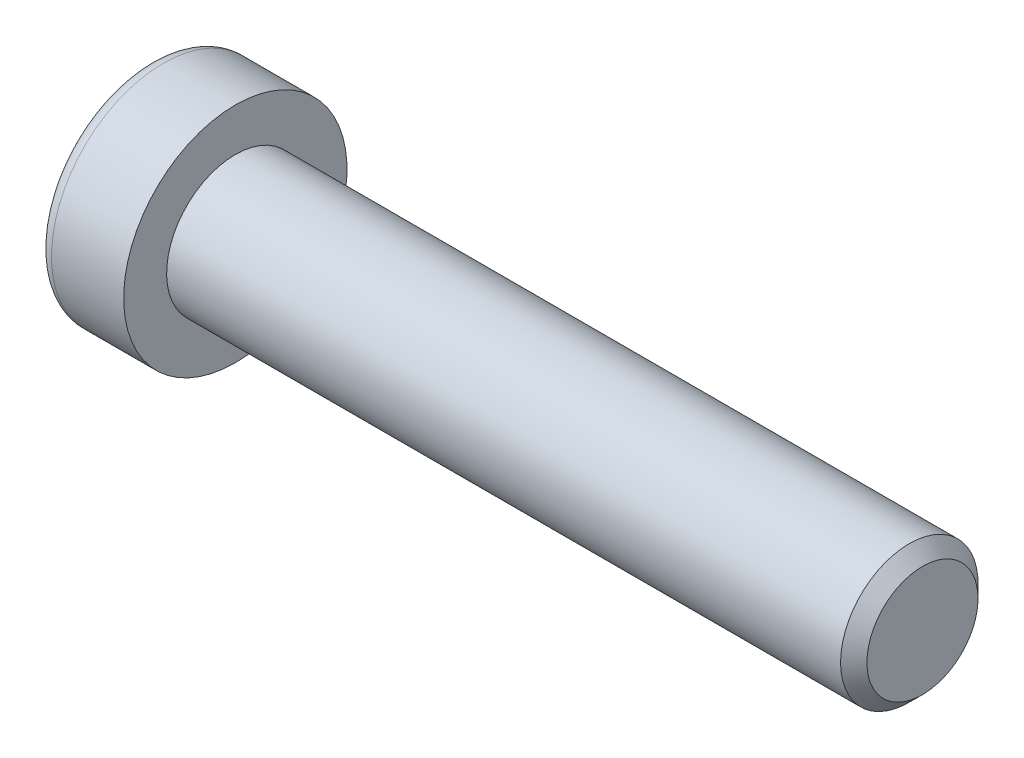
ISO-10303-21;
HEADER;
FILE_DESCRIPTION(('STEP AP214'),'2;1');
FILE_NAME('part.step','',(''),(''),'','','');
FILE_SCHEMA(('AUTOMOTIVE_DESIGN { 1 0 10303 214 1 1 1 1 }'));
ENDSEC;
DATA;
#1=APPLICATION_CONTEXT('core data for automotive mechanical design processes');
#2=APPLICATION_PROTOCOL_DEFINITION('international standard','automotive_design',2000,#1);
#3=PRODUCT_CONTEXT('',#1,'mechanical');
#4=PRODUCT('Part','Part','',(#3));
#5=PRODUCT_RELATED_PRODUCT_CATEGORY('part','',(#4));
#6=PRODUCT_DEFINITION_FORMATION('','',#4);
#7=PRODUCT_DEFINITION_CONTEXT('part definition',#1,'design');
#8=PRODUCT_DEFINITION('design','',#6,#7);
#9=PRODUCT_DEFINITION_SHAPE('','',#8);
#10=(LENGTH_UNIT() NAMED_UNIT(*) SI_UNIT(.MILLI.,.METRE.));
#11=(NAMED_UNIT(*) PLANE_ANGLE_UNIT() SI_UNIT($,.RADIAN.));
#12=(NAMED_UNIT(*) SI_UNIT($,.STERADIAN.) SOLID_ANGLE_UNIT());
#13=UNCERTAINTY_MEASURE_WITH_UNIT(LENGTH_MEASURE(1.E-05),#10,'distance_accuracy_value','');
#14=(GEOMETRIC_REPRESENTATION_CONTEXT(3) GLOBAL_UNCERTAINTY_ASSIGNED_CONTEXT((#13)) GLOBAL_UNIT_ASSIGNED_CONTEXT((#10,
#11,#12)) REPRESENTATION_CONTEXT('',''));
#15=CARTESIAN_POINT('',(0.,0.,0.));
#16=DIRECTION('',(0.,0.,1.));
#17=DIRECTION('',(1.,0.,0.));
#18=AXIS2_PLACEMENT_3D('',#15,#16,#17);
#19=CARTESIAN_POINT('',(-1.21000000177673,0.,0.));
#20=DIRECTION('',(-1.,0.,0.));
#21=DIRECTION('',(0.,0.,1.));
#22=AXIS2_PLACEMENT_3D('',#19,#20,#21);
#23=CONICAL_SURFACE('',#22,2.9040718530382,1.04719754996794);
#24=CARTESIAN_POINT('',(0.466666669012739,-1.13686837721616E-10,0.));
#25=VERTEX_POINT('',#24);
#26=VERTEX_LOOP('',#25);
#27=FACE_BOUND('',#26,.T.);
#28=CARTESIAN_POINT('',(-1.20000000188032,2.50000000042828,1.44337567243126));
#29=CARTESIAN_POINT('',(-1.16336943336427,2.50000000015382,1.31652043353318));
#30=CARTESIAN_POINT('',(-1.13005584831707,2.50000000004123,1.18857018203745));
#31=CARTESIAN_POINT('',(-1.07190798610144,2.49999999995868,0.930454306037677));
#32=CARTESIAN_POINT('',(-1.04709427719735,2.49999999998906,0.800284096806924));
#33=CARTESIAN_POINT('',(-1.00846995036617,2.50000000001067,0.541556812494233));
#34=CARTESIAN_POINT('',(-0.994402236162447,2.50000000000284,0.413039534770439));
#35=CARTESIAN_POINT('',(-0.977611461824864,2.49999999999716,0.155400578562858));
#36=CARTESIAN_POINT('',(-0.974874494142074,2.49999999999929,0.0262798358840899));
#37=CARTESIAN_POINT('',(-0.980582864422355,2.50000000000062,-0.21496841995549));
#38=CARTESIAN_POINT('',(-0.987626608278002,2.50000000000017,-0.327132134383147));
#39=CARTESIAN_POINT('',(-1.00994662771906,2.49999999999983,-0.550728853222557));
#40=CARTESIAN_POINT('',(-1.02523052031715,2.49999999999995,-0.66216108485018));
#41=CARTESIAN_POINT('',(-1.06343729360609,2.50000000000005,-0.886218434015897));
#42=CARTESIAN_POINT('',(-1.08652205474861,2.50000000000003,-0.998815208377872));
#43=CARTESIAN_POINT('',(-1.13891470311393,2.49999999999998,-1.2223298619213));
#44=CARTESIAN_POINT('',(-1.16821028805135,2.49999999999995,-1.33325060237494));
#45=CARTESIAN_POINT('',(-1.20000000215881,2.5,-1.44337567242466));
#46=B_SPLINE_CURVE_WITH_KNOTS('',3,(#28,#29,#30,#31,#32,#33,#34,#35,#36,#37,#38,#39,#40,#41,#42,
#43,#44,#45),.UNSPECIFIED.,.F.,.F.,(4,2,2,2,2,2,2,2,4),(0.,0.396270014515872,0.793492271437725,
1.18088450788727,1.56780111135406,1.90463472821334,2.24178024186127,2.58640202744164,
2.93034746593166),.UNSPECIFIED.);
#47=CARTESIAN_POINT('',(-1.20000000213914,2.49999999973261,1.44337567281968));
#48=VERTEX_POINT('',#47);
#49=CARTESIAN_POINT('',(-1.20000000222827,2.5,-1.44337567266531));
#50=VERTEX_POINT('',#49);
#51=EDGE_CURVE('E19',#48,#50,#46,.T.);
#52=ORIENTED_EDGE('',*,*,#51,.T.);
#53=CARTESIAN_POINT('',(-1.20000000188032,2.49999999974405,-1.44337567361636));
#54=CARTESIAN_POINT('',(-1.16336943336427,2.39014014011794,-1.50680329282772));
#55=CARTESIAN_POINT('',(-1.13005584831707,2.27933197184574,-1.57077841847808));
#56=CARTESIAN_POINT('',(-1.07190798610144,2.05579706606859,-1.69983635640647));
#57=CARTESIAN_POINT('',(-1.04709427719735,1.94306635807401,-1.76492146104816));
#58=CARTESIAN_POINT('',(-1.00846995036617,1.71900195721787,-1.89428510322322));
#59=CARTESIAN_POINT('',(-0.994402236162446,1.60770272987993,-1.95854374207834));
#60=CARTESIAN_POINT('',(-0.977611461824863,1.38458084879682,-2.08736322017721));
#61=CARTESIAN_POINT('',(-0.974874494142074,1.27275900548255,-2.15192359151843));
#62=CARTESIAN_POINT('',(-0.980582864422354,1.06383188730746,-2.27254771943938));
#63=CARTESIAN_POINT('',(-0.987626608278001,0.966695261230055,-2.32862957665281));
#64=CARTESIAN_POINT('',(-1.00994662771905,0.773054822512112,-2.44042793607223));
#65=CARTESIAN_POINT('',(-1.02523052031715,0.676551679122258,-2.49614405188614));
#66=CARTESIAN_POINT('',(-1.06343729360609,0.482512322840195,-2.60817272646909));
#67=CARTESIAN_POINT('',(-1.08652205474861,0.385000655858529,-2.66447111365005));
#68=CARTESIAN_POINT('',(-1.13891470311393,0.191431287771819,-2.77622844042172));
#69=CARTESIAN_POINT('',(-1.16821028805135,0.09537110873237,-2.83168881064853));
#70=CARTESIAN_POINT('',(-1.20000000215881,4.75795613603965E-10,-2.88675134567343));
#71=B_SPLINE_CURVE_WITH_KNOTS('',3,(#53,#54,#55,#56,#57,#58,#59,#60,#61,#62,#63,#64,#65,#66,#67,
#68,#69,#70),.UNSPECIFIED.,.F.,.F.,(4,2,2,2,2,2,2,2,4),(0.,0.396270014515872,0.793492271437724,
1.18088450788727,1.56780111135406,1.90463472821334,2.24178024186127,2.58640202744164,
2.93034746593166),.UNSPECIFIED.);
#72=CARTESIAN_POINT('',(-1.20000000213914,0.,-2.88675134563937));
#73=VERTEX_POINT('',#72);
#74=EDGE_CURVE('E79',#50,#73,#71,.T.);
#75=ORIENTED_EDGE('',*,*,#74,.T.);
#76=CARTESIAN_POINT('',(-1.20000000188032,-6.84219602471756E-10,-2.88675134604762));
#77=CARTESIAN_POINT('',(-1.16336943336427,-0.109859860035873,-2.8233237263609));
#78=CARTESIAN_POINT('',(-1.13005584831707,-0.220668028195489,-2.75934860051552));
#79=CARTESIAN_POINT('',(-1.07190798610144,-0.444202933890087,-2.63029066244415));
#80=CARTESIAN_POINT('',(-1.04709427719735,-0.556933641915047,-2.56520555785509));
#81=CARTESIAN_POINT('',(-1.00846995036617,-0.780998042792801,-2.43584191571745));
#82=CARTESIAN_POINT('',(-0.994402236162447,-0.892297270122914,-2.37158327684878));
#83=CARTESIAN_POINT('',(-0.977611461824864,-1.11541915120034,-2.24276379874007));
#84=CARTESIAN_POINT('',(-0.974874494142073,-1.22724099451673,-2.17820342740253));
#85=CARTESIAN_POINT('',(-0.980582864422354,-1.43616811269316,-2.05757929948389));
#86=CARTESIAN_POINT('',(-0.987626608278001,-1.53330473877011,-2.00149744226967));
#87=CARTESIAN_POINT('',(-1.00994662771906,-1.72694517748772,-1.88969908284967));
#88=CARTESIAN_POINT('',(-1.02523052031715,-1.82344832087769,-1.83398296703597));
#89=CARTESIAN_POINT('',(-1.06343729360609,-2.01748767715985,-1.72195429245319));
#90=CARTESIAN_POINT('',(-1.08652205474861,-2.1149993441415,-1.66565590527218));
#91=CARTESIAN_POINT('',(-1.13891470311393,-2.30856871222816,-1.55389857850043));
#92=CARTESIAN_POINT('',(-1.16821028805135,-2.40462889126758,-1.49843820827358));
#93=CARTESIAN_POINT('',(-1.20000000215881,-2.49999999952421,-1.44337567324877));
#94=B_SPLINE_CURVE_WITH_KNOTS('',3,(#76,#77,#78,#79,#80,#81,#82,#83,#84,#85,#86,#87,#88,#89,#90,
#91,#92,#93),.UNSPECIFIED.,.F.,.F.,(4,2,2,2,2,2,2,2,4),(0.,0.396270014515872,0.793492271437725,
1.18088450788727,1.56780111135406,1.90463472821334,2.24178024186127,2.58640202744164,
2.93034746593167),.UNSPECIFIED.);
#95=CARTESIAN_POINT('',(-1.20000000213914,-2.49999999973261,-1.44337567281968));
#96=VERTEX_POINT('',#95);
#97=EDGE_CURVE('E104',#73,#96,#94,.T.);
#98=ORIENTED_EDGE('',*,*,#97,.T.);
#99=CARTESIAN_POINT('',(-1.20000000188032,-2.50000000042828,-1.44337567243126));
#100=CARTESIAN_POINT('',(-1.16336943336427,-2.50000000015382,-1.31652043353318));
#101=CARTESIAN_POINT('',(-1.13005584831707,-2.50000000004123,-1.18857018203745));
#102=CARTESIAN_POINT('',(-1.07190798610144,-2.49999999995868,-0.93045430603768));
#103=CARTESIAN_POINT('',(-1.04709427719735,-2.49999999998906,-0.800284096806928));
#104=CARTESIAN_POINT('',(-1.00846995036617,-2.50000000001067,-0.541556812494236));
#105=CARTESIAN_POINT('',(-0.994402236162447,-2.50000000000284,-0.413039534770443));
#106=CARTESIAN_POINT('',(-0.977611461824863,-2.49999999999716,-0.155400578562862));
#107=CARTESIAN_POINT('',(-0.974874494142073,-2.49999999999929,-0.0262798358840941));
#108=CARTESIAN_POINT('',(-0.980582864422354,-2.50000000000062,0.214968419955486));
#109=CARTESIAN_POINT('',(-0.987626608278001,-2.50000000000017,0.327132134383144));
#110=CARTESIAN_POINT('',(-1.00994662771905,-2.49999999999983,0.550728853222554));
#111=CARTESIAN_POINT('',(-1.02523052031715,-2.49999999999995,0.662161084850177));
#112=CARTESIAN_POINT('',(-1.06343729360609,-2.50000000000005,0.886218434015895));
#113=CARTESIAN_POINT('',(-1.08652205474861,-2.50000000000002,0.99881520837787));
#114=CARTESIAN_POINT('',(-1.13891470311393,-2.49999999999998,1.2223298619213));
#115=CARTESIAN_POINT('',(-1.16821028805135,-2.49999999999995,1.33325060237494));
#116=CARTESIAN_POINT('',(-1.20000000215881,-2.5,1.44337567242466));
#117=B_SPLINE_CURVE_WITH_KNOTS('',3,(#99,#100,#101,#102,#103,#104,#105,#106,#107,#108,#109,#110,
#111,#112,#113,#114,#115,#116),.UNSPECIFIED.,.F.,.F.,(4,2,2,2,2,2,2,2,4),(0.,0.396270014515872,
0.793492271437724,1.18088450788727,1.56780111135406,1.90463472821334,2.24178024186127,
2.58640202744164,2.93034746593167),.UNSPECIFIED.);
#118=CARTESIAN_POINT('',(-1.20000000213914,-2.49999999973261,1.44337567281969));
#119=VERTEX_POINT('',#118);
#120=EDGE_CURVE('E128',#96,#119,#117,.T.);
#121=ORIENTED_EDGE('',*,*,#120,.T.);
#122=CARTESIAN_POINT('',(-1.20000000188032,-2.49999999974406,1.44337567361636));
#123=CARTESIAN_POINT('',(-1.16336943336427,-2.39014014011795,1.50680329282772));
#124=CARTESIAN_POINT('',(-1.13005584831707,-2.27933197184574,1.57077841847807));
#125=CARTESIAN_POINT('',(-1.07190798610144,-2.05579706606859,1.69983635640647));
#126=CARTESIAN_POINT('',(-1.04709427719735,-1.94306635807401,1.76492146104816));
#127=CARTESIAN_POINT('',(-1.00846995036617,-1.71900195721787,1.89428510322322));
#128=CARTESIAN_POINT('',(-0.994402236162447,-1.60770272987993,1.95854374207834));
#129=CARTESIAN_POINT('',(-0.977611461824864,-1.38458084879682,2.08736322017721));
#130=CARTESIAN_POINT('',(-0.974874494142074,-1.27275900548255,2.15192359151843));
#131=CARTESIAN_POINT('',(-0.980582864422354,-1.06383188730746,2.27254771943938));
#132=CARTESIAN_POINT('',(-0.987626608278001,-0.966695261230056,2.32862957665281));
#133=CARTESIAN_POINT('',(-1.00994662771905,-0.773054822512113,2.44042793607223));
#134=CARTESIAN_POINT('',(-1.02523052031715,-0.676551679122259,2.49614405188614));
#135=CARTESIAN_POINT('',(-1.06343729360609,-0.482512322840196,2.60817272646909));
#136=CARTESIAN_POINT('',(-1.08652205474861,-0.385000655858529,2.66447111365005));
#137=CARTESIAN_POINT('',(-1.13891470311393,-0.19143128777182,2.77622844042172));
#138=CARTESIAN_POINT('',(-1.16821028805135,-0.0953711087323703,2.83168881064852));
#139=CARTESIAN_POINT('',(-1.20000000215881,-4.75795563263291E-10,2.88675134567343));
#140=B_SPLINE_CURVE_WITH_KNOTS('',3,(#122,#123,#124,#125,#126,#127,#128,#129,#130,#131,#132,
#133,#134,#135,#136,#137,#138,#139),.UNSPECIFIED.,.F.,.F.,(4,2,2,2,2,2,2,2,4),(0.,
0.396270014515872,0.793492271437724,1.18088450788727,1.56780111135406,1.90463472821334,
2.24178024186127,2.58640202744164,2.93034746593167),.UNSPECIFIED.);
#141=CARTESIAN_POINT('',(-1.20000000213914,0.,2.88675134563937));
#142=VERTEX_POINT('',#141);
#143=EDGE_CURVE('E136',#119,#142,#140,.T.);
#144=ORIENTED_EDGE('',*,*,#143,.T.);
#145=CARTESIAN_POINT('',(-1.20000000188032,6.84218568248128E-10,2.88675134604763));
#146=CARTESIAN_POINT('',(-1.16336943336427,0.109859860035872,2.8233237263609));
#147=CARTESIAN_POINT('',(-1.13005584831707,0.220668028195487,2.75934860051552));
#148=CARTESIAN_POINT('',(-1.07190798610144,0.444202933890086,2.63029066244415));
#149=CARTESIAN_POINT('',(-1.04709427719735,0.556933641915045,2.56520555785509));
#150=CARTESIAN_POINT('',(-1.00846995036617,0.7809980427928,2.43584191571745));
#151=CARTESIAN_POINT('',(-0.994402236162446,0.892297270122912,2.37158327684878));
#152=CARTESIAN_POINT('',(-0.977611461824863,1.11541915120034,2.24276379874007));
#153=CARTESIAN_POINT('',(-0.974874494142073,1.22724099451673,2.17820342740253));
#154=CARTESIAN_POINT('',(-0.980582864422353,1.43616811269316,2.05757929948389));
#155=CARTESIAN_POINT('',(-0.987626608278,1.53330473877011,2.00149744226967));
#156=CARTESIAN_POINT('',(-1.00994662771905,1.72694517748772,1.88969908284967));
#157=CARTESIAN_POINT('',(-1.02523052031715,1.82344832087769,1.83398296703596));
#158=CARTESIAN_POINT('',(-1.06343729360609,2.01748767715985,1.72195429245319));
#159=CARTESIAN_POINT('',(-1.08652205474861,2.1149993441415,1.66565590527218));
#160=CARTESIAN_POINT('',(-1.13891470311393,2.30856871222816,1.55389857850042));
#161=CARTESIAN_POINT('',(-1.16821028805135,2.40462889126758,1.49843820827358));
#162=CARTESIAN_POINT('',(-1.2000000021588,2.49999999952421,1.44337567324876));
#163=B_SPLINE_CURVE_WITH_KNOTS('',3,(#145,#146,#147,#148,#149,#150,#151,#152,#153,#154,#155,
#156,#157,#158,#159,#160,#161,#162),.UNSPECIFIED.,.F.,.F.,(4,2,2,2,2,2,2,2,4),(0.,
0.396270014515872,0.793492271437725,1.18088450788727,1.56780111135406,1.90463472821334,
2.24178024186127,2.58640202744164,2.93034746593167),.UNSPECIFIED.);
#164=EDGE_CURVE('E81',#142,#48,#163,.T.);
#165=ORIENTED_EDGE('',*,*,#164,.T.);
#166=EDGE_LOOP('',(#52,#75,#98,#121,#144,#165));
#167=FACE_BOUND('',#166,.T.);
#168=ADVANCED_FACE('F15',(#27,#167),#23,.F.);
#169=CARTESIAN_POINT('',(-5.,2.5,1.44337567297406));
#170=DIRECTION('',(0.,1.,0.));
#171=DIRECTION('',(0.,0.,1.));
#172=AXIS2_PLACEMENT_3D('',#169,#170,#171);
#173=PLANE('',#172);
#174=DIRECTION('',(1.,0.,0.));
#175=VECTOR('',#174,1.);
#176=CARTESIAN_POINT('',(-5.,2.5,1.44337567297406));
#177=LINE('',#176,#175);
#178=CARTESIAN_POINT('',(-5.,2.5,1.44337567297406));
#179=VERTEX_POINT('',#178);
#180=EDGE_CURVE('E83',#48,#179,#177,.F.);
#181=ORIENTED_EDGE('',*,*,#180,.T.);
#182=DIRECTION('',(0.,0.,1.));
#183=VECTOR('',#182,1.);
#184=CARTESIAN_POINT('',(-5.,2.5,0.));
#185=LINE('',#184,#183);
#186=CARTESIAN_POINT('',(-5.,2.5,-1.44337567297407));
#187=VERTEX_POINT('',#186);
#188=EDGE_CURVE('E88',#187,#179,#185,.T.);
#189=ORIENTED_EDGE('',*,*,#188,.F.);
#190=DIRECTION('',(1.,0.,0.));
#191=VECTOR('',#190,1.);
#192=CARTESIAN_POINT('',(-5.,2.5,-1.44337567297407));
#193=LINE('',#192,#191);
#194=EDGE_CURVE('E86',#187,#50,#193,.T.);
#195=ORIENTED_EDGE('',*,*,#194,.T.);
#196=ORIENTED_EDGE('',*,*,#51,.F.);
#197=EDGE_LOOP('',(#181,#189,#195,#196));
#198=FACE_BOUND('',#197,.T.);
#199=ADVANCED_FACE('F75',(#198),#173,.F.);
#200=CARTESIAN_POINT('',(-5.,0.,2.88675134594813));
#201=DIRECTION('',(0.,0.500000000000001,0.866025403784438));
#202=DIRECTION('',(0.,-0.866025403784438,0.500000000000001));
#203=AXIS2_PLACEMENT_3D('',#200,#201,#202);
#204=PLANE('',#203);
#205=DIRECTION('',(1.,0.,0.));
#206=VECTOR('',#205,1.);
#207=CARTESIAN_POINT('',(-5.,0.,2.88675134594813));
#208=LINE('',#207,#206);
#209=CARTESIAN_POINT('',(-5.,0.,2.88675134594813));
#210=VERTEX_POINT('',#209);
#211=EDGE_CURVE('E140',#142,#210,#208,.F.);
#212=ORIENTED_EDGE('',*,*,#211,.T.);
#213=DIRECTION('',(0.,-0.866025403784438,0.500000000000001));
#214=VECTOR('',#213,1.);
#215=CARTESIAN_POINT('',(-5.,2.5,1.44337567297406));
#216=LINE('',#215,#214);
#217=EDGE_CURVE('E94',#179,#210,#216,.T.);
#218=ORIENTED_EDGE('',*,*,#217,.F.);
#219=ORIENTED_EDGE('',*,*,#180,.F.);
#220=ORIENTED_EDGE('',*,*,#164,.F.);
#221=EDGE_LOOP('',(#212,#218,#219,#220));
#222=FACE_BOUND('',#221,.T.);
#223=ADVANCED_FACE('F144',(#222),#204,.F.);
#224=CARTESIAN_POINT('',(-5.,-2.5,1.44337567297406));
#225=DIRECTION('',(0.,-0.5,0.866025403784439));
#226=DIRECTION('',(0.,-0.866025403784439,-0.5));
#227=AXIS2_PLACEMENT_3D('',#224,#225,#226);
#228=PLANE('',#227);
#229=DIRECTION('',(1.,0.,0.));
#230=VECTOR('',#229,1.);
#231=CARTESIAN_POINT('',(-5.,-2.5,1.44337567297406));
#232=LINE('',#231,#230);
#233=CARTESIAN_POINT('',(-5.,-2.5,1.44337567297406));
#234=VERTEX_POINT('',#233);
#235=EDGE_CURVE('E135',#119,#234,#232,.F.);
#236=ORIENTED_EDGE('',*,*,#235,.T.);
#237=DIRECTION('',(0.,-0.866025403784439,-0.5));
#238=VECTOR('',#237,1.);
#239=CARTESIAN_POINT('',(-5.,0.,2.88675134594813));
#240=LINE('',#239,#238);
#241=EDGE_CURVE('E223',#210,#234,#240,.T.);
#242=ORIENTED_EDGE('',*,*,#241,.F.);
#243=ORIENTED_EDGE('',*,*,#211,.F.);
#244=ORIENTED_EDGE('',*,*,#143,.F.);
#245=EDGE_LOOP('',(#236,#242,#243,#244));
#246=FACE_BOUND('',#245,.T.);
#247=ADVANCED_FACE('F124',(#246),#228,.F.);
#248=CARTESIAN_POINT('',(-5.,-2.5,-1.44337567297406));
#249=DIRECTION('',(0.,-1.,0.));
#250=DIRECTION('',(0.,0.,-1.));
#251=AXIS2_PLACEMENT_3D('',#248,#249,#250);
#252=PLANE('',#251);
#253=DIRECTION('',(1.,0.,0.));
#254=VECTOR('',#253,1.);
#255=CARTESIAN_POINT('',(-5.,-2.5,-1.44337567297406));
#256=LINE('',#255,#254);
#257=CARTESIAN_POINT('',(-5.,-2.5,-1.44337567297406));
#258=VERTEX_POINT('',#257);
#259=EDGE_CURVE('E134',#96,#258,#256,.F.);
#260=ORIENTED_EDGE('',*,*,#259,.T.);
#261=DIRECTION('',(0.,0.,1.));
#262=VECTOR('',#261,1.);
#263=CARTESIAN_POINT('',(-5.,-2.5,0.));
#264=LINE('',#263,#262);
#265=EDGE_CURVE('E220',#234,#258,#264,.F.);
#266=ORIENTED_EDGE('',*,*,#265,.F.);
#267=ORIENTED_EDGE('',*,*,#235,.F.);
#268=ORIENTED_EDGE('',*,*,#120,.F.);
#269=EDGE_LOOP('',(#260,#266,#267,#268));
#270=FACE_BOUND('',#269,.T.);
#271=ADVANCED_FACE('F120',(#270),#252,.F.);
#272=CARTESIAN_POINT('',(-5.,0.,-2.88675134594813));
#273=DIRECTION('',(0.,-0.5,-0.866025403784439));
#274=DIRECTION('',(0.,0.866025403784439,-0.5));
#275=AXIS2_PLACEMENT_3D('',#272,#273,#274);
#276=PLANE('',#275);
#277=DIRECTION('',(1.,0.,0.));
#278=VECTOR('',#277,1.);
#279=CARTESIAN_POINT('',(-5.,0.,-2.88675134594813));
#280=LINE('',#279,#278);
#281=CARTESIAN_POINT('',(-5.,0.,-2.88675134594813));
#282=VERTEX_POINT('',#281);
#283=EDGE_CURVE('E37',#73,#282,#280,.F.);
#284=ORIENTED_EDGE('',*,*,#283,.T.);
#285=DIRECTION('',(0.,0.866025403784438,-0.500000000000001));
#286=VECTOR('',#285,1.);
#287=CARTESIAN_POINT('',(-5.,-2.5,-1.44337567297406));
#288=LINE('',#287,#286);
#289=EDGE_CURVE('E217',#258,#282,#288,.T.);
#290=ORIENTED_EDGE('',*,*,#289,.F.);
#291=ORIENTED_EDGE('',*,*,#259,.F.);
#292=ORIENTED_EDGE('',*,*,#97,.F.);
#293=EDGE_LOOP('',(#284,#290,#291,#292));
#294=FACE_BOUND('',#293,.T.);
#295=ADVANCED_FACE('F114',(#294),#276,.F.);
#296=CARTESIAN_POINT('',(-5.,2.5,-1.44337567297407));
#297=DIRECTION('',(0.,0.5,-0.866025403784439));
#298=DIRECTION('',(0.,0.866025403784439,0.5));
#299=AXIS2_PLACEMENT_3D('',#296,#297,#298);
#300=PLANE('',#299);
#301=ORIENTED_EDGE('',*,*,#194,.F.);
#302=DIRECTION('',(0.,0.866025403784439,0.5));
#303=VECTOR('',#302,1.);
#304=CARTESIAN_POINT('',(-5.,0.,-2.88675134594813));
#305=LINE('',#304,#303);
#306=EDGE_CURVE('E215',#282,#187,#305,.T.);
#307=ORIENTED_EDGE('',*,*,#306,.F.);
#308=ORIENTED_EDGE('',*,*,#283,.F.);
#309=ORIENTED_EDGE('',*,*,#74,.F.);
#310=EDGE_LOOP('',(#301,#307,#308,#309));
#311=FACE_BOUND('',#310,.T.);
#312=ADVANCED_FACE('F92',(#311),#300,.F.);
#313=CARTESIAN_POINT('',(-5.,4.69337567297407,0.));
#314=DIRECTION('',(-1.,0.,0.));
#315=DIRECTION('',(0.,0.,1.));
#316=AXIS2_PLACEMENT_3D('',#313,#314,#315);
#317=PLANE('',#316);
#318=ORIENTED_EDGE('',*,*,#289,.T.);
#319=ORIENTED_EDGE('',*,*,#306,.T.);
#320=ORIENTED_EDGE('',*,*,#188,.T.);
#321=ORIENTED_EDGE('',*,*,#217,.T.);
#322=ORIENTED_EDGE('',*,*,#241,.T.);
#323=ORIENTED_EDGE('',*,*,#265,.T.);
#324=EDGE_LOOP('',(#318,#319,#320,#321,#322,#323));
#325=FACE_BOUND('',#324,.T.);
#326=CARTESIAN_POINT('',(-5.,0.,0.));
#327=DIRECTION('',(1.,0.,0.));
#328=DIRECTION('',(0.,1.,0.));
#329=AXIS2_PLACEMENT_3D('',#326,#327,#328);
#330=CIRCLE('',#329,5.7);
#331=CARTESIAN_POINT('',(-5.,5.7,0.));
#332=VERTEX_POINT('',#331);
#333=EDGE_CURVE('E192',#332,#332,#330,.T.);
#334=ORIENTED_EDGE('',*,*,#333,.F.);
#335=EDGE_LOOP('',(#334));
#336=FACE_BOUND('',#335,.T.);
#337=ADVANCED_FACE('F113',(#325,#336),#317,.T.);
#338=CARTESIAN_POINT('',(-4.2,0.,0.));
#339=DIRECTION('',(1.,0.,0.));
#340=DIRECTION('',(0.,0.,-1.));
#341=AXIS2_PLACEMENT_3D('',#338,#339,#340);
#342=TOROIDAL_SURFACE('',#341,5.7,0.8);
#343=CARTESIAN_POINT('',(-4.2,0.,0.));
#344=DIRECTION('',(1.,0.,0.));
#345=DIRECTION('',(0.,1.,0.));
#346=AXIS2_PLACEMENT_3D('',#343,#344,#345);
#347=CIRCLE('',#346,6.5);
#348=CARTESIAN_POINT('',(-4.2,6.5,0.));
#349=VERTEX_POINT('',#348);
#350=EDGE_CURVE('E233',#349,#349,#347,.T.);
#351=ORIENTED_EDGE('',*,*,#350,.F.);
#352=EDGE_LOOP('',(#351));
#353=FACE_BOUND('',#352,.T.);
#354=ORIENTED_EDGE('',*,*,#333,.T.);
#355=EDGE_LOOP('',(#354));
#356=FACE_BOUND('',#355,.T.);
#357=ADVANCED_FACE('F176',(#353,#356),#342,.T.);
#358=CARTESIAN_POINT('',(-2.5,0.,0.));
#359=DIRECTION('',(1.,0.,0.));
#360=DIRECTION('',(0.,1.,0.));
#361=AXIS2_PLACEMENT_3D('',#358,#359,#360);
#362=CYLINDRICAL_SURFACE('',#361,6.5);
#363=ORIENTED_EDGE('',*,*,#350,.T.);
#364=EDGE_LOOP('',(#363));
#365=FACE_BOUND('',#364,.T.);
#366=CARTESIAN_POINT('',(0.,0.,0.));
#367=DIRECTION('',(1.,0.,0.));
#368=DIRECTION('',(0.,1.,0.));
#369=AXIS2_PLACEMENT_3D('',#366,#367,#368);
#370=CIRCLE('',#369,6.5);
#371=CARTESIAN_POINT('',(0.,6.5,0.));
#372=VERTEX_POINT('',#371);
#373=EDGE_CURVE('E102',#372,#372,#370,.T.);
#374=ORIENTED_EDGE('',*,*,#373,.F.);
#375=EDGE_LOOP('',(#374));
#376=FACE_BOUND('',#375,.T.);
#377=ADVANCED_FACE('F173',(#365,#376),#362,.T.);
#378=CARTESIAN_POINT('',(40.,2.,0.));
#379=DIRECTION('',(1.,0.,0.));
#380=DIRECTION('',(0.,0.,-1.));
#381=AXIS2_PLACEMENT_3D('',#378,#379,#380);
#382=PLANE('',#381);
#383=CARTESIAN_POINT('',(40.0000000003047,0.,0.));
#384=DIRECTION('',(-1.,0.,0.));
#385=DIRECTION('',(0.,0.,1.));
#386=AXIS2_PLACEMENT_3D('',#383,#384,#385);
#387=CIRCLE('',#386,3.2331875003706);
#388=CARTESIAN_POINT('',(40.0000000003047,0.,3.2331875003706));
#389=VERTEX_POINT('',#388);
#390=EDGE_CURVE('E229',#389,#389,#387,.T.);
#391=ORIENTED_EDGE('',*,*,#390,.F.);
#392=EDGE_LOOP('',(#391));
#393=FACE_BOUND('',#392,.T.);
#394=ADVANCED_FACE('F169',(#393),#382,.T.);
#395=CARTESIAN_POINT('',(0.,5.25,0.));
#396=DIRECTION('',(1.,0.,0.));
#397=DIRECTION('',(0.,0.,-1.));
#398=AXIS2_PLACEMENT_3D('',#395,#396,#397);
#399=PLANE('',#398);
#400=CARTESIAN_POINT('',(0.,0.,0.));
#401=DIRECTION('',(1.,0.,0.));
#402=DIRECTION('',(0.,1.,0.));
#403=AXIS2_PLACEMENT_3D('',#400,#401,#402);
#404=CIRCLE('',#403,4.);
#405=CARTESIAN_POINT('',(0.,4.,0.));
#406=VERTEX_POINT('',#405);
#407=EDGE_CURVE('E28',#406,#406,#404,.T.);
#408=ORIENTED_EDGE('',*,*,#407,.F.);
#409=EDGE_LOOP('',(#408));
#410=FACE_BOUND('',#409,.T.);
#411=ORIENTED_EDGE('',*,*,#373,.T.);
#412=EDGE_LOOP('',(#411));
#413=FACE_BOUND('',#412,.T.);
#414=ADVANCED_FACE('F162',(#410,#413),#399,.T.);
#415=CARTESIAN_POINT('',(39.2331874996898,0.,0.));
#416=DIRECTION('',(-1.,0.,0.));
#417=DIRECTION('',(0.,0.,1.));
#418=AXIS2_PLACEMENT_3D('',#415,#416,#417);
#419=CONICAL_SURFACE('',#418,3.99999999967804,0.785398162544959);
#420=ORIENTED_EDGE('',*,*,#390,.T.);
#421=EDGE_LOOP('',(#420));
#422=FACE_BOUND('',#421,.T.);
#423=CARTESIAN_POINT('',(39.2331875,0.,0.));
#424=DIRECTION('',(1.,0.,0.));
#425=DIRECTION('',(0.,1.,0.));
#426=AXIS2_PLACEMENT_3D('',#423,#424,#425);
#427=CIRCLE('',#426,4.);
#428=CARTESIAN_POINT('',(39.2331875,4.,0.));
#429=VERTEX_POINT('',#428);
#430=EDGE_CURVE('E10',#429,#429,#427,.F.);
#431=ORIENTED_EDGE('',*,*,#430,.F.);
#432=EDGE_LOOP('',(#431));
#433=FACE_BOUND('',#432,.T.);
#434=ADVANCED_FACE('F155',(#422,#433),#419,.T.);
#435=CARTESIAN_POINT('',(29.,0.,0.));
#436=DIRECTION('',(1.,0.,0.));
#437=DIRECTION('',(0.,1.,0.));
#438=AXIS2_PLACEMENT_3D('',#435,#436,#437);
#439=CYLINDRICAL_SURFACE('',#438,4.);
#440=ORIENTED_EDGE('',*,*,#430,.T.);
#441=EDGE_LOOP('',(#440));
#442=FACE_BOUND('',#441,.T.);
#443=ORIENTED_EDGE('',*,*,#407,.T.);
#444=EDGE_LOOP('',(#443));
#445=FACE_BOUND('',#444,.T.);
#446=ADVANCED_FACE('F153',(#442,#445),#439,.T.);
#447=CLOSED_SHELL('',(#168,#199,#223,#247,#271,#295,#312,#337,#357,#377,#394,#414,#434,#446));
#448=MANIFOLD_SOLID_BREP('B1',#447);
#449=ADVANCED_BREP_SHAPE_REPRESENTATION('',(#18,#448),#14);
#450=SHAPE_DEFINITION_REPRESENTATION(#9,#449);
ENDSEC;
END-ISO-10303-21;
